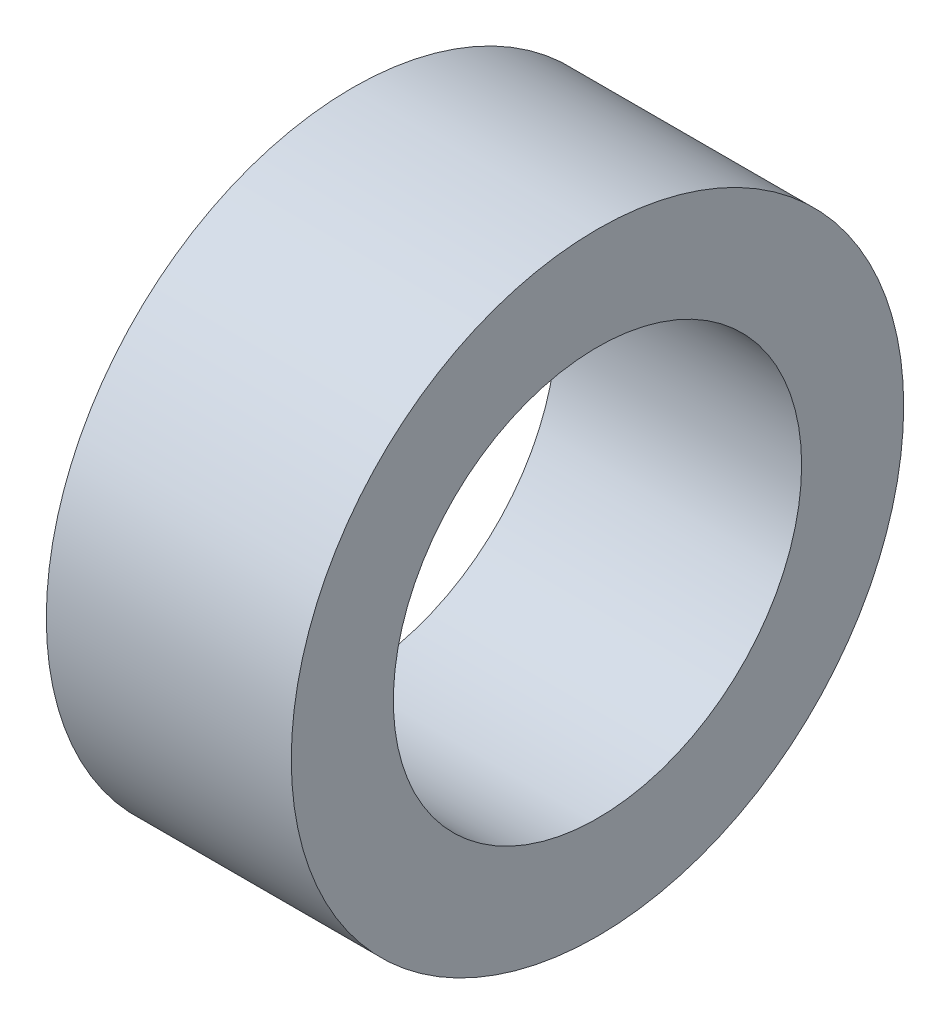
ISO-10303-21;
HEADER;
FILE_DESCRIPTION(('STEP AP214'),'2;1');
FILE_NAME('part.step','',(''),(''),'','','');
FILE_SCHEMA(('AUTOMOTIVE_DESIGN { 1 0 10303 214 1 1 1 1 }'));
ENDSEC;
DATA;
#1=APPLICATION_CONTEXT('core data for automotive mechanical design processes');
#2=APPLICATION_PROTOCOL_DEFINITION('international standard','automotive_design',2000,#1);
#3=PRODUCT_CONTEXT('',#1,'mechanical');
#4=PRODUCT('Part','Part','',(#3));
#5=PRODUCT_RELATED_PRODUCT_CATEGORY('part','',(#4));
#6=PRODUCT_DEFINITION_FORMATION('','',#4);
#7=PRODUCT_DEFINITION_CONTEXT('part definition',#1,'design');
#8=PRODUCT_DEFINITION('design','',#6,#7);
#9=PRODUCT_DEFINITION_SHAPE('','',#8);
#10=(LENGTH_UNIT() NAMED_UNIT(*) SI_UNIT(.MILLI.,.METRE.));
#11=(NAMED_UNIT(*) PLANE_ANGLE_UNIT() SI_UNIT($,.RADIAN.));
#12=(NAMED_UNIT(*) SI_UNIT($,.STERADIAN.) SOLID_ANGLE_UNIT());
#13=UNCERTAINTY_MEASURE_WITH_UNIT(LENGTH_MEASURE(1.E-05),#10,'distance_accuracy_value','');
#14=(GEOMETRIC_REPRESENTATION_CONTEXT(3) GLOBAL_UNCERTAINTY_ASSIGNED_CONTEXT((#13)) GLOBAL_UNIT_ASSIGNED_CONTEXT((#10,
#11,#12)) REPRESENTATION_CONTEXT('',''));
#15=CARTESIAN_POINT('',(0.,0.,0.));
#16=DIRECTION('',(0.,0.,1.));
#17=DIRECTION('',(1.,0.,0.));
#18=AXIS2_PLACEMENT_3D('',#15,#16,#17);
#19=CARTESIAN_POINT('',(12.,0.,0.));
#20=DIRECTION('',(1.,0.,0.));
#21=DIRECTION('',(0.,0.,-1.));
#22=AXIS2_PLACEMENT_3D('',#19,#20,#21);
#23=PLANE('',#22);
#24=CARTESIAN_POINT('',(12.,0.,0.));
#25=DIRECTION('',(1.,0.,0.));
#26=DIRECTION('',(0.,0.,-1.));
#27=AXIS2_PLACEMENT_3D('',#24,#25,#26);
#28=CIRCLE('',#27,15.);
#29=CARTESIAN_POINT('',(12.,0.,-15.));
#30=VERTEX_POINT('',#29);
#31=EDGE_CURVE('E10',#30,#30,#28,.T.);
#32=ORIENTED_EDGE('',*,*,#31,.T.);
#33=EDGE_LOOP('',(#32));
#34=FACE_BOUND('',#33,.T.);
#35=CARTESIAN_POINT('',(12.,0.,0.));
#36=DIRECTION('',(1.,0.,0.));
#37=DIRECTION('',(0.,0.,-1.));
#38=AXIS2_PLACEMENT_3D('',#35,#36,#37);
#39=CIRCLE('',#38,10.);
#40=CARTESIAN_POINT('',(12.,0.,-10.));
#41=VERTEX_POINT('',#40);
#42=EDGE_CURVE('E45',#41,#41,#39,.T.);
#43=ORIENTED_EDGE('',*,*,#42,.F.);
#44=EDGE_LOOP('',(#43));
#45=FACE_BOUND('',#44,.T.);
#46=ADVANCED_FACE('F34',(#34,#45),#23,.T.);
#47=CARTESIAN_POINT('',(0.,0.,0.));
#48=DIRECTION('',(1.,0.,0.));
#49=DIRECTION('',(0.,0.,-1.));
#50=AXIS2_PLACEMENT_3D('',#47,#48,#49);
#51=PLANE('',#50);
#52=CARTESIAN_POINT('',(0.,0.,0.));
#53=DIRECTION('',(1.,0.,0.));
#54=DIRECTION('',(0.,0.,-1.));
#55=AXIS2_PLACEMENT_3D('',#52,#53,#54);
#56=CIRCLE('',#55,15.);
#57=CARTESIAN_POINT('',(0.,0.,-15.));
#58=VERTEX_POINT('',#57);
#59=EDGE_CURVE('E38',#58,#58,#56,.T.);
#60=ORIENTED_EDGE('',*,*,#59,.F.);
#61=EDGE_LOOP('',(#60));
#62=FACE_BOUND('',#61,.T.);
#63=CARTESIAN_POINT('',(0.,0.,0.));
#64=DIRECTION('',(1.,0.,0.));
#65=DIRECTION('',(0.,0.,-1.));
#66=AXIS2_PLACEMENT_3D('',#63,#64,#65);
#67=CIRCLE('',#66,10.);
#68=CARTESIAN_POINT('',(0.,0.,-10.));
#69=VERTEX_POINT('',#68);
#70=EDGE_CURVE('E47',#69,#69,#67,.T.);
#71=ORIENTED_EDGE('',*,*,#70,.T.);
#72=EDGE_LOOP('',(#71));
#73=FACE_BOUND('',#72,.T.);
#74=ADVANCED_FACE('F57',(#62,#73),#51,.F.);
#75=CARTESIAN_POINT('',(12.,0.,0.));
#76=DIRECTION('',(-1.,0.,0.));
#77=DIRECTION('',(0.,0.,1.));
#78=AXIS2_PLACEMENT_3D('',#75,#76,#77);
#79=CYLINDRICAL_SURFACE('',#78,15.);
#80=ORIENTED_EDGE('',*,*,#31,.F.);
#81=EDGE_LOOP('',(#80));
#82=FACE_BOUND('',#81,.T.);
#83=ORIENTED_EDGE('',*,*,#59,.T.);
#84=EDGE_LOOP('',(#83));
#85=FACE_BOUND('',#84,.T.);
#86=ADVANCED_FACE('F36',(#82,#85),#79,.T.);
#87=CARTESIAN_POINT('',(12.,0.,0.));
#88=DIRECTION('',(-1.,0.,0.));
#89=DIRECTION('',(0.,0.,1.));
#90=AXIS2_PLACEMENT_3D('',#87,#88,#89);
#91=CYLINDRICAL_SURFACE('',#90,10.);
#92=ORIENTED_EDGE('',*,*,#42,.T.);
#93=EDGE_LOOP('',(#92));
#94=FACE_BOUND('',#93,.T.);
#95=ORIENTED_EDGE('',*,*,#70,.F.);
#96=EDGE_LOOP('',(#95));
#97=FACE_BOUND('',#96,.T.);
#98=ADVANCED_FACE('F53',(#94,#97),#91,.F.);
#99=CLOSED_SHELL('',(#46,#74,#86,#98));
#100=MANIFOLD_SOLID_BREP('B2',#99);
#101=ADVANCED_BREP_SHAPE_REPRESENTATION('',(#18,#100),#14);
#102=SHAPE_DEFINITION_REPRESENTATION(#9,#101);
ENDSEC;
END-ISO-10303-21;
